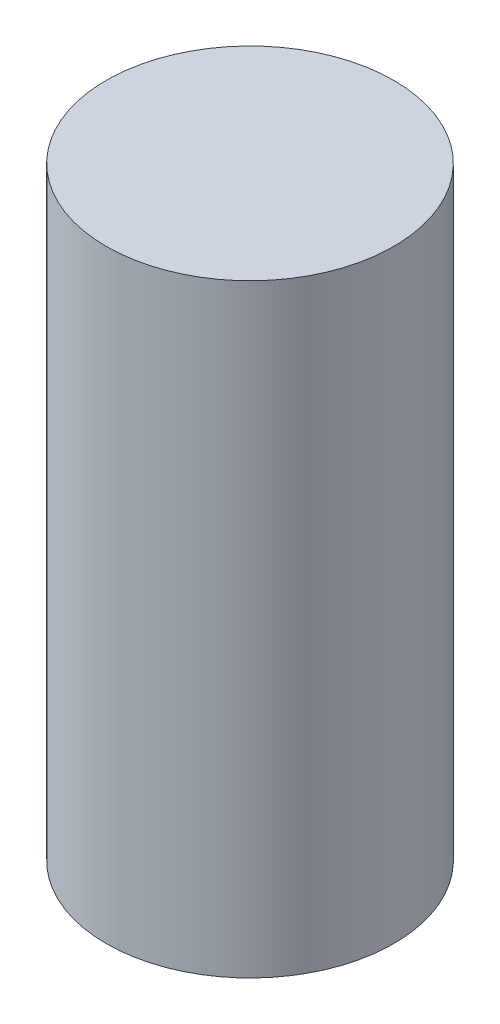
ISO-10303-21;
HEADER;
FILE_DESCRIPTION(('STEP AP214'),'2;1');
FILE_NAME('part.step','',(''),(''),'','','');
FILE_SCHEMA(('AUTOMOTIVE_DESIGN { 1 0 10303 214 1 1 1 1 }'));
ENDSEC;
DATA;
#1=APPLICATION_CONTEXT('core data for automotive mechanical design processes');
#2=APPLICATION_PROTOCOL_DEFINITION('international standard','automotive_design',2000,#1);
#3=PRODUCT_CONTEXT('',#1,'mechanical');
#4=PRODUCT('Part','Part','',(#3));
#5=PRODUCT_RELATED_PRODUCT_CATEGORY('part','',(#4));
#6=PRODUCT_DEFINITION_FORMATION('','',#4);
#7=PRODUCT_DEFINITION_CONTEXT('part definition',#1,'design');
#8=PRODUCT_DEFINITION('design','',#6,#7);
#9=PRODUCT_DEFINITION_SHAPE('','',#8);
#10=(LENGTH_UNIT() NAMED_UNIT(*) SI_UNIT(.MILLI.,.METRE.));
#11=(NAMED_UNIT(*) PLANE_ANGLE_UNIT() SI_UNIT($,.RADIAN.));
#12=(NAMED_UNIT(*) SI_UNIT($,.STERADIAN.) SOLID_ANGLE_UNIT());
#13=UNCERTAINTY_MEASURE_WITH_UNIT(LENGTH_MEASURE(1.E-05),#10,'distance_accuracy_value','');
#14=(GEOMETRIC_REPRESENTATION_CONTEXT(3) GLOBAL_UNCERTAINTY_ASSIGNED_CONTEXT((#13)) GLOBAL_UNIT_ASSIGNED_CONTEXT((#10,
#11,#12)) REPRESENTATION_CONTEXT('',''));
#15=CARTESIAN_POINT('',(0.,0.,0.));
#16=DIRECTION('',(0.,0.,1.));
#17=DIRECTION('',(1.,0.,0.));
#18=AXIS2_PLACEMENT_3D('',#15,#16,#17);
#19=CARTESIAN_POINT('',(0.,10.,0.));
#20=DIRECTION('',(0.,-1.,0.));
#21=DIRECTION('',(0.,0.,-1.));
#22=AXIS2_PLACEMENT_3D('',#19,#20,#21);
#23=CYLINDRICAL_SURFACE('',#22,2.38125);
#24=CARTESIAN_POINT('',(0.,10.,0.));
#25=DIRECTION('',(0.,1.,0.));
#26=DIRECTION('',(0.,0.,1.));
#27=AXIS2_PLACEMENT_3D('',#24,#25,#26);
#28=CIRCLE('',#27,2.38125);
#29=CARTESIAN_POINT('',(0.,10.,2.38125));
#30=VERTEX_POINT('',#29);
#31=EDGE_CURVE('E10',#30,#30,#28,.T.);
#32=ORIENTED_EDGE('',*,*,#31,.F.);
#33=EDGE_LOOP('',(#32));
#34=FACE_BOUND('',#33,.T.);
#35=CARTESIAN_POINT('',(0.,0.,0.));
#36=DIRECTION('',(0.,1.,0.));
#37=DIRECTION('',(0.,0.,1.));
#38=AXIS2_PLACEMENT_3D('',#35,#36,#37);
#39=CIRCLE('',#38,2.38125);
#40=CARTESIAN_POINT('',(0.,0.,2.38125));
#41=VERTEX_POINT('',#40);
#42=EDGE_CURVE('E35',#41,#41,#39,.T.);
#43=ORIENTED_EDGE('',*,*,#42,.T.);
#44=EDGE_LOOP('',(#43));
#45=FACE_BOUND('',#44,.T.);
#46=ADVANCED_FACE('F32',(#34,#45),#23,.T.);
#47=CARTESIAN_POINT('',(0.,10.,0.));
#48=DIRECTION('',(0.,1.,0.));
#49=DIRECTION('',(0.,0.,1.));
#50=AXIS2_PLACEMENT_3D('',#47,#48,#49);
#51=PLANE('',#50);
#52=ORIENTED_EDGE('',*,*,#31,.T.);
#53=EDGE_LOOP('',(#52));
#54=FACE_BOUND('',#53,.T.);
#55=ADVANCED_FACE('F47',(#54),#51,.T.);
#56=CARTESIAN_POINT('',(0.,0.,0.));
#57=DIRECTION('',(0.,1.,0.));
#58=DIRECTION('',(0.,0.,1.));
#59=AXIS2_PLACEMENT_3D('',#56,#57,#58);
#60=PLANE('',#59);
#61=ORIENTED_EDGE('',*,*,#42,.F.);
#62=EDGE_LOOP('',(#61));
#63=FACE_BOUND('',#62,.T.);
#64=ADVANCED_FACE('F45',(#63),#60,.F.);
#65=CLOSED_SHELL('',(#46,#55,#64));
#66=MANIFOLD_SOLID_BREP('B2',#65);
#67=ADVANCED_BREP_SHAPE_REPRESENTATION('',(#18,#66),#14);
#68=SHAPE_DEFINITION_REPRESENTATION(#9,#67);
ENDSEC;
END-ISO-10303-21;
